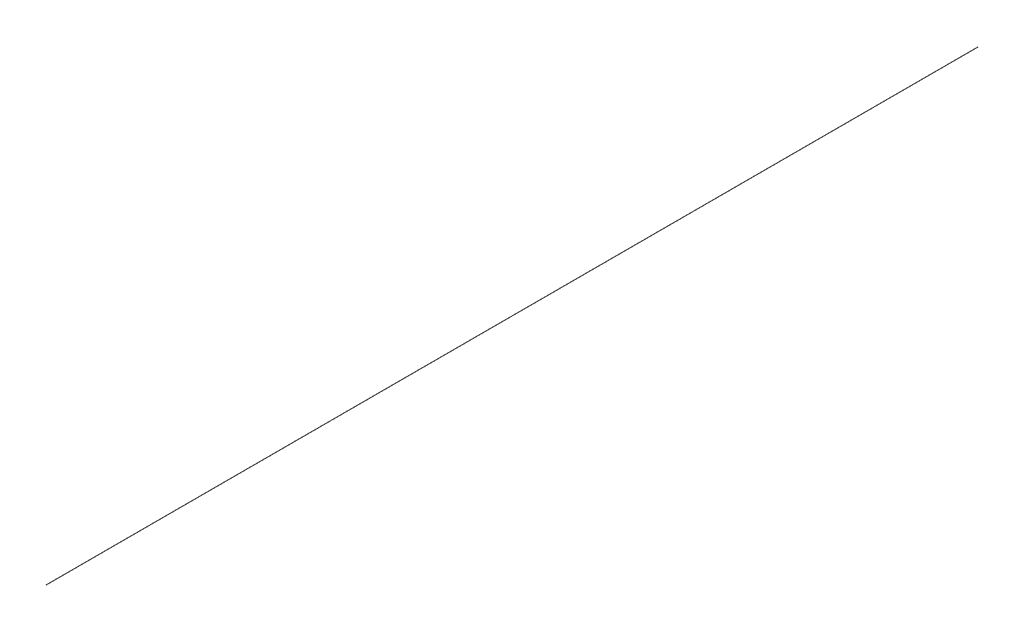
ISO-10303-21;
HEADER;
FILE_DESCRIPTION(('STEP AP214'),'2;1');
FILE_NAME('part.step','',(''),(''),'','','');
FILE_SCHEMA(('AUTOMOTIVE_DESIGN { 1 0 10303 214 1 1 1 1 }'));
ENDSEC;
DATA;
#1=APPLICATION_CONTEXT('core data for automotive mechanical design processes');
#2=APPLICATION_PROTOCOL_DEFINITION('international standard','automotive_design',2000,#1);
#3=PRODUCT_CONTEXT('',#1,'mechanical');
#4=PRODUCT('Part','Part','',(#3));
#5=PRODUCT_RELATED_PRODUCT_CATEGORY('part','',(#4));
#6=PRODUCT_DEFINITION_FORMATION('','',#4);
#7=PRODUCT_DEFINITION_CONTEXT('part definition',#1,'design');
#8=PRODUCT_DEFINITION('design','',#6,#7);
#9=PRODUCT_DEFINITION_SHAPE('','',#8);
#10=(LENGTH_UNIT() NAMED_UNIT(*) SI_UNIT(.MILLI.,.METRE.));
#11=(NAMED_UNIT(*) PLANE_ANGLE_UNIT() SI_UNIT($,.RADIAN.));
#12=(NAMED_UNIT(*) SI_UNIT($,.STERADIAN.) SOLID_ANGLE_UNIT());
#13=UNCERTAINTY_MEASURE_WITH_UNIT(LENGTH_MEASURE(1.E-05),#10,'distance_accuracy_value','');
#14=(GEOMETRIC_REPRESENTATION_CONTEXT(3) GLOBAL_UNCERTAINTY_ASSIGNED_CONTEXT((#13)) GLOBAL_UNIT_ASSIGNED_CONTEXT((#10,
#11,#12)) REPRESENTATION_CONTEXT('',''));
#15=CARTESIAN_POINT('',(0.,0.,0.));
#16=DIRECTION('',(0.,0.,1.));
#17=DIRECTION('',(1.,0.,0.));
#18=AXIS2_PLACEMENT_3D('',#15,#16,#17);
#19=CARTESIAN_POINT('',(0.,0.,-26193.8));
#20=DIRECTION('',(0.,0.,1.));
#21=DIRECTION('',(1.,0.,0.));
#22=AXIS2_PLACEMENT_3D('',#19,#20,#21);
#23=CYLINDRICAL_SURFACE('',#22,3.175);
#24=CARTESIAN_POINT('',(0.,0.,-26193.8));
#25=DIRECTION('',(0.,0.,1.));
#26=DIRECTION('',(1.,0.,0.));
#27=AXIS2_PLACEMENT_3D('',#24,#25,#26);
#28=CIRCLE('',#27,3.175);
#29=CARTESIAN_POINT('',(3.175,0.,-26193.8));
#30=VERTEX_POINT('',#29);
#31=EDGE_CURVE('E10',#30,#30,#28,.T.);
#32=ORIENTED_EDGE('',*,*,#31,.T.);
#33=EDGE_LOOP('',(#32));
#34=FACE_BOUND('',#33,.T.);
#35=CARTESIAN_POINT('',(0.,0.,0.));
#36=DIRECTION('',(0.,0.,1.));
#37=DIRECTION('',(1.,0.,0.));
#38=AXIS2_PLACEMENT_3D('',#35,#36,#37);
#39=CIRCLE('',#38,3.175);
#40=CARTESIAN_POINT('',(3.175,0.,0.));
#41=VERTEX_POINT('',#40);
#42=EDGE_CURVE('E40',#41,#41,#39,.T.);
#43=ORIENTED_EDGE('',*,*,#42,.F.);
#44=EDGE_LOOP('',(#43));
#45=FACE_BOUND('',#44,.T.);
#46=ADVANCED_FACE('F37',(#34,#45),#23,.T.);
#47=CARTESIAN_POINT('',(0.,0.,-26193.8));
#48=DIRECTION('',(0.,0.,1.));
#49=DIRECTION('',(1.,0.,0.));
#50=AXIS2_PLACEMENT_3D('',#47,#48,#49);
#51=PLANE('',#50);
#52=ORIENTED_EDGE('',*,*,#31,.F.);
#53=EDGE_LOOP('',(#52));
#54=FACE_BOUND('',#53,.T.);
#55=ADVANCED_FACE('F54',(#54),#51,.F.);
#56=CARTESIAN_POINT('',(0.,0.,0.));
#57=DIRECTION('',(0.,0.,1.));
#58=DIRECTION('',(1.,0.,0.));
#59=AXIS2_PLACEMENT_3D('',#56,#57,#58);
#60=PLANE('',#59);
#61=ORIENTED_EDGE('',*,*,#42,.T.);
#62=EDGE_LOOP('',(#61));
#63=FACE_BOUND('',#62,.T.);
#64=ADVANCED_FACE('F51',(#63),#60,.T.);
#65=CLOSED_SHELL('',(#46,#55,#64));
#66=MANIFOLD_SOLID_BREP('B2',#65);
#67=ADVANCED_BREP_SHAPE_REPRESENTATION('',(#18,#66),#14);
#68=SHAPE_DEFINITION_REPRESENTATION(#9,#67);
ENDSEC;
END-ISO-10303-21;
